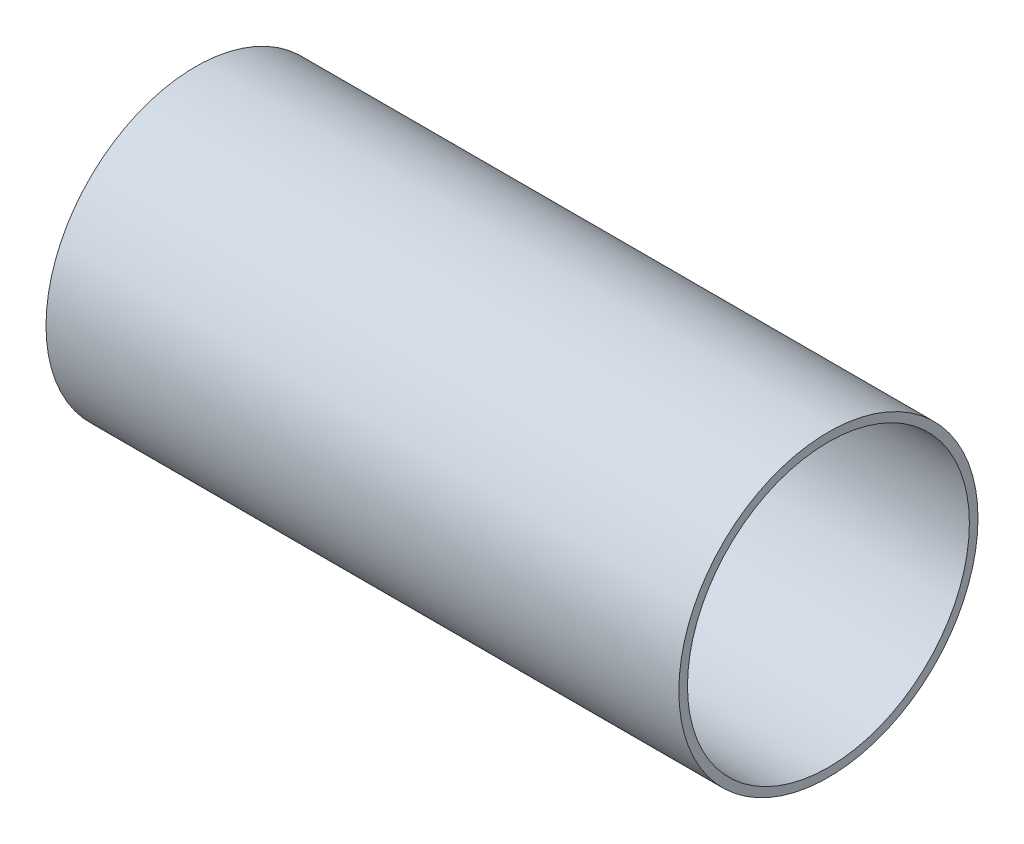
ISO-10303-21;
HEADER;
FILE_DESCRIPTION(('STEP AP214'),'2;1');
FILE_NAME('part.step','',(''),(''),'','','');
FILE_SCHEMA(('AUTOMOTIVE_DESIGN { 1 0 10303 214 1 1 1 1 }'));
ENDSEC;
DATA;
#1=APPLICATION_CONTEXT('core data for automotive mechanical design processes');
#2=APPLICATION_PROTOCOL_DEFINITION('international standard','automotive_design',2000,#1);
#3=PRODUCT_CONTEXT('',#1,'mechanical');
#4=PRODUCT('Part','Part','',(#3));
#5=PRODUCT_RELATED_PRODUCT_CATEGORY('part','',(#4));
#6=PRODUCT_DEFINITION_FORMATION('','',#4);
#7=PRODUCT_DEFINITION_CONTEXT('part definition',#1,'design');
#8=PRODUCT_DEFINITION('design','',#6,#7);
#9=PRODUCT_DEFINITION_SHAPE('','',#8);
#10=(LENGTH_UNIT() NAMED_UNIT(*) SI_UNIT(.MILLI.,.METRE.));
#11=(NAMED_UNIT(*) PLANE_ANGLE_UNIT() SI_UNIT($,.RADIAN.));
#12=(NAMED_UNIT(*) SI_UNIT($,.STERADIAN.) SOLID_ANGLE_UNIT());
#13=UNCERTAINTY_MEASURE_WITH_UNIT(LENGTH_MEASURE(1.E-05),#10,'distance_accuracy_value','');
#14=(GEOMETRIC_REPRESENTATION_CONTEXT(3) GLOBAL_UNCERTAINTY_ASSIGNED_CONTEXT((#13)) GLOBAL_UNIT_ASSIGNED_CONTEXT((#10,
#11,#12)) REPRESENTATION_CONTEXT('',''));
#15=CARTESIAN_POINT('',(0.,0.,0.));
#16=DIRECTION('',(0.,0.,1.));
#17=DIRECTION('',(1.,0.,0.));
#18=AXIS2_PLACEMENT_3D('',#15,#16,#17);
#19=CARTESIAN_POINT('',(220.,0.,0.));
#20=DIRECTION('',(1.,0.,0.));
#21=DIRECTION('',(0.,0.,-1.));
#22=AXIS2_PLACEMENT_3D('',#19,#20,#21);
#23=PLANE('',#22);
#24=CARTESIAN_POINT('',(220.,0.,0.));
#25=DIRECTION('',(1.,0.,0.));
#26=DIRECTION('',(0.,0.,-1.));
#27=AXIS2_PLACEMENT_3D('',#24,#25,#26);
#28=CIRCLE('',#27,52.);
#29=CARTESIAN_POINT('',(220.,0.,-52.));
#30=VERTEX_POINT('',#29);
#31=EDGE_CURVE('E10',#30,#30,#28,.T.);
#32=ORIENTED_EDGE('',*,*,#31,.T.);
#33=EDGE_LOOP('',(#32));
#34=FACE_BOUND('',#33,.T.);
#35=CARTESIAN_POINT('',(220.,0.,0.));
#36=DIRECTION('',(1.,0.,0.));
#37=DIRECTION('',(0.,0.,-1.));
#38=AXIS2_PLACEMENT_3D('',#35,#36,#37);
#39=CIRCLE('',#38,49.);
#40=CARTESIAN_POINT('',(220.,0.,-49.));
#41=VERTEX_POINT('',#40);
#42=EDGE_CURVE('E45',#41,#41,#39,.T.);
#43=ORIENTED_EDGE('',*,*,#42,.F.);
#44=EDGE_LOOP('',(#43));
#45=FACE_BOUND('',#44,.T.);
#46=ADVANCED_FACE('F34',(#34,#45),#23,.T.);
#47=CARTESIAN_POINT('',(0.,0.,0.));
#48=DIRECTION('',(1.,0.,0.));
#49=DIRECTION('',(0.,0.,-1.));
#50=AXIS2_PLACEMENT_3D('',#47,#48,#49);
#51=PLANE('',#50);
#52=CARTESIAN_POINT('',(0.,0.,0.));
#53=DIRECTION('',(1.,0.,0.));
#54=DIRECTION('',(0.,0.,-1.));
#55=AXIS2_PLACEMENT_3D('',#52,#53,#54);
#56=CIRCLE('',#55,52.);
#57=CARTESIAN_POINT('',(0.,0.,-52.));
#58=VERTEX_POINT('',#57);
#59=EDGE_CURVE('E38',#58,#58,#56,.T.);
#60=ORIENTED_EDGE('',*,*,#59,.F.);
#61=EDGE_LOOP('',(#60));
#62=FACE_BOUND('',#61,.T.);
#63=CARTESIAN_POINT('',(0.,0.,0.));
#64=DIRECTION('',(1.,0.,0.));
#65=DIRECTION('',(0.,0.,-1.));
#66=AXIS2_PLACEMENT_3D('',#63,#64,#65);
#67=CIRCLE('',#66,49.);
#68=CARTESIAN_POINT('',(0.,0.,-49.));
#69=VERTEX_POINT('',#68);
#70=EDGE_CURVE('E47',#69,#69,#67,.T.);
#71=ORIENTED_EDGE('',*,*,#70,.T.);
#72=EDGE_LOOP('',(#71));
#73=FACE_BOUND('',#72,.T.);
#74=ADVANCED_FACE('F57',(#62,#73),#51,.F.);
#75=CARTESIAN_POINT('',(220.,0.,0.));
#76=DIRECTION('',(-1.,0.,0.));
#77=DIRECTION('',(0.,0.,1.));
#78=AXIS2_PLACEMENT_3D('',#75,#76,#77);
#79=CYLINDRICAL_SURFACE('',#78,52.);
#80=ORIENTED_EDGE('',*,*,#31,.F.);
#81=EDGE_LOOP('',(#80));
#82=FACE_BOUND('',#81,.T.);
#83=ORIENTED_EDGE('',*,*,#59,.T.);
#84=EDGE_LOOP('',(#83));
#85=FACE_BOUND('',#84,.T.);
#86=ADVANCED_FACE('F36',(#82,#85),#79,.T.);
#87=CARTESIAN_POINT('',(220.,0.,0.));
#88=DIRECTION('',(-1.,0.,0.));
#89=DIRECTION('',(0.,0.,1.));
#90=AXIS2_PLACEMENT_3D('',#87,#88,#89);
#91=CYLINDRICAL_SURFACE('',#90,49.);
#92=ORIENTED_EDGE('',*,*,#42,.T.);
#93=EDGE_LOOP('',(#92));
#94=FACE_BOUND('',#93,.T.);
#95=ORIENTED_EDGE('',*,*,#70,.F.);
#96=EDGE_LOOP('',(#95));
#97=FACE_BOUND('',#96,.T.);
#98=ADVANCED_FACE('F53',(#94,#97),#91,.F.);
#99=CLOSED_SHELL('',(#46,#74,#86,#98));
#100=MANIFOLD_SOLID_BREP('B2',#99);
#101=ADVANCED_BREP_SHAPE_REPRESENTATION('',(#18,#100),#14);
#102=SHAPE_DEFINITION_REPRESENTATION(#9,#101);
ENDSEC;
END-ISO-10303-21;
